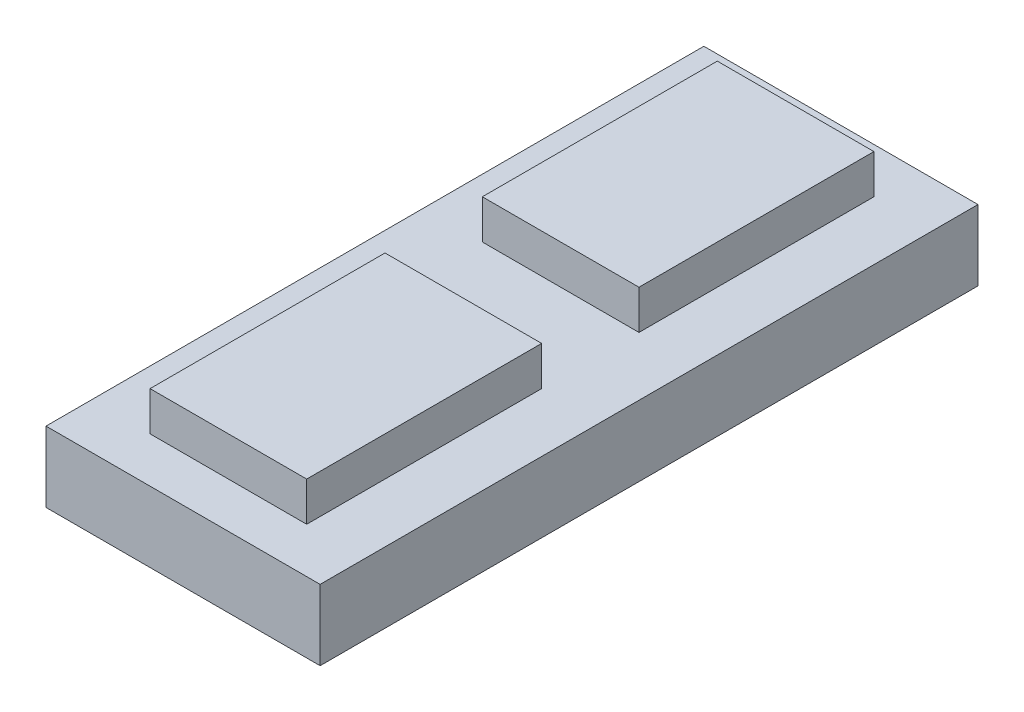
ISO-10303-21;
HEADER;
FILE_DESCRIPTION(('STEP AP214'),'2;1');
FILE_NAME('part.step','',(''),(''),'','','');
FILE_SCHEMA(('AUTOMOTIVE_DESIGN { 1 0 10303 214 1 1 1 1 }'));
ENDSEC;
DATA;
#1=APPLICATION_CONTEXT('core data for automotive mechanical design processes');
#2=APPLICATION_PROTOCOL_DEFINITION('international standard','automotive_design',2000,#1);
#3=PRODUCT_CONTEXT('',#1,'mechanical');
#4=PRODUCT('Part','Part','',(#3));
#5=PRODUCT_RELATED_PRODUCT_CATEGORY('part','',(#4));
#6=PRODUCT_DEFINITION_FORMATION('','',#4);
#7=PRODUCT_DEFINITION_CONTEXT('part definition',#1,'design');
#8=PRODUCT_DEFINITION('design','',#6,#7);
#9=PRODUCT_DEFINITION_SHAPE('','',#8);
#10=(LENGTH_UNIT() NAMED_UNIT(*) SI_UNIT(.MILLI.,.METRE.));
#11=(NAMED_UNIT(*) PLANE_ANGLE_UNIT() SI_UNIT($,.RADIAN.));
#12=(NAMED_UNIT(*) SI_UNIT($,.STERADIAN.) SOLID_ANGLE_UNIT());
#13=UNCERTAINTY_MEASURE_WITH_UNIT(LENGTH_MEASURE(1.E-05),#10,'distance_accuracy_value','');
#14=(GEOMETRIC_REPRESENTATION_CONTEXT(3) GLOBAL_UNCERTAINTY_ASSIGNED_CONTEXT((#13)) GLOBAL_UNIT_ASSIGNED_CONTEXT((#10,
#11,#12)) REPRESENTATION_CONTEXT('',''));
#15=CARTESIAN_POINT('',(0.,0.,0.));
#16=DIRECTION('',(0.,0.,1.));
#17=DIRECTION('',(1.,0.,0.));
#18=AXIS2_PLACEMENT_3D('',#15,#16,#17);
#19=CARTESIAN_POINT('',(0.,14.,6.213224670746));
#20=DIRECTION('',(0.,0.,-1.));
#21=DIRECTION('',(-1.,0.,0.));
#22=AXIS2_PLACEMENT_3D('',#19,#20,#21);
#23=PLANE('',#22);
#24=DIRECTION('',(1.,0.,0.));
#25=VECTOR('',#24,1.);
#26=CARTESIAN_POINT('',(0.,9.,6.213224670746));
#27=LINE('',#26,#25);
#28=CARTESIAN_POINT('',(-10.,9.,6.213224670746));
#29=VERTEX_POINT('',#28);
#30=CARTESIAN_POINT('',(10.,9.,6.213224670746));
#31=VERTEX_POINT('',#30);
#32=EDGE_CURVE('E127',#29,#31,#27,.T.);
#33=ORIENTED_EDGE('',*,*,#32,.F.);
#34=DIRECTION('',(0.,-1.,0.));
#35=VECTOR('',#34,1.);
#36=CARTESIAN_POINT('',(-10.,14.,6.213224670746));
#37=LINE('',#36,#35);
#38=CARTESIAN_POINT('',(-10.,14.,6.213224670746));
#39=VERTEX_POINT('',#38);
#40=EDGE_CURVE('E12',#39,#29,#37,.T.);
#41=ORIENTED_EDGE('',*,*,#40,.F.);
#42=DIRECTION('',(1.,0.,0.));
#43=VECTOR('',#42,1.);
#44=CARTESIAN_POINT('',(0.,14.,6.213224670746));
#45=LINE('',#44,#43);
#46=CARTESIAN_POINT('',(10.,14.,6.213224670746));
#47=VERTEX_POINT('',#46);
#48=EDGE_CURVE('E112',#39,#47,#45,.T.);
#49=ORIENTED_EDGE('',*,*,#48,.T.);
#50=DIRECTION('',(0.,-1.,0.));
#51=VECTOR('',#50,1.);
#52=CARTESIAN_POINT('',(10.,14.,6.213224670746));
#53=LINE('',#52,#51);
#54=EDGE_CURVE('E80',#47,#31,#53,.T.);
#55=ORIENTED_EDGE('',*,*,#54,.T.);
#56=EDGE_LOOP('',(#33,#41,#49,#55));
#57=FACE_BOUND('',#56,.T.);
#58=ADVANCED_FACE('F64',(#57),#23,.T.);
#59=CARTESIAN_POINT('',(-10.,14.,0.));
#60=DIRECTION('',(1.,0.,0.));
#61=DIRECTION('',(0.,0.,-1.));
#62=AXIS2_PLACEMENT_3D('',#59,#60,#61);
#63=PLANE('',#62);
#64=DIRECTION('',(0.,0.,1.));
#65=VECTOR('',#64,1.);
#66=CARTESIAN_POINT('',(-10.,9.,0.));
#67=LINE('',#66,#65);
#68=CARTESIAN_POINT('',(-10.,9.,36.213224670746));
#69=VERTEX_POINT('',#68);
#70=EDGE_CURVE('E118',#29,#69,#67,.T.);
#71=ORIENTED_EDGE('',*,*,#70,.T.);
#72=DIRECTION('',(0.,-1.,0.));
#73=VECTOR('',#72,1.);
#74=CARTESIAN_POINT('',(-10.,14.,36.213224670746));
#75=LINE('',#74,#73);
#76=CARTESIAN_POINT('',(-10.,14.,36.213224670746));
#77=VERTEX_POINT('',#76);
#78=EDGE_CURVE('E72',#77,#69,#75,.T.);
#79=ORIENTED_EDGE('',*,*,#78,.F.);
#80=DIRECTION('',(0.,0.,1.));
#81=VECTOR('',#80,1.);
#82=CARTESIAN_POINT('',(-10.,14.,0.));
#83=LINE('',#82,#81);
#84=EDGE_CURVE('E106',#39,#77,#83,.T.);
#85=ORIENTED_EDGE('',*,*,#84,.F.);
#86=ORIENTED_EDGE('',*,*,#40,.T.);
#87=EDGE_LOOP('',(#71,#79,#85,#86));
#88=FACE_BOUND('',#87,.T.);
#89=ADVANCED_FACE('F116',(#88),#63,.F.);
#90=CARTESIAN_POINT('',(0.,14.,36.213224670746));
#91=DIRECTION('',(0.,0.,-1.));
#92=DIRECTION('',(-1.,0.,0.));
#93=AXIS2_PLACEMENT_3D('',#90,#91,#92);
#94=PLANE('',#93);
#95=DIRECTION('',(1.,0.,0.));
#96=VECTOR('',#95,1.);
#97=CARTESIAN_POINT('',(0.,9.,36.213224670746));
#98=LINE('',#97,#96);
#99=CARTESIAN_POINT('',(10.,9.,36.213224670746));
#100=VERTEX_POINT('',#99);
#101=EDGE_CURVE('E130',#69,#100,#98,.T.);
#102=ORIENTED_EDGE('',*,*,#101,.T.);
#103=DIRECTION('',(0.,-1.,0.));
#104=VECTOR('',#103,1.);
#105=CARTESIAN_POINT('',(10.,14.,36.213224670746));
#106=LINE('',#105,#104);
#107=CARTESIAN_POINT('',(10.,14.,36.213224670746));
#108=VERTEX_POINT('',#107);
#109=EDGE_CURVE('E94',#108,#100,#106,.T.);
#110=ORIENTED_EDGE('',*,*,#109,.F.);
#111=DIRECTION('',(1.,0.,0.));
#112=VECTOR('',#111,1.);
#113=CARTESIAN_POINT('',(0.,14.,36.213224670746));
#114=LINE('',#113,#112);
#115=EDGE_CURVE('E111',#77,#108,#114,.T.);
#116=ORIENTED_EDGE('',*,*,#115,.F.);
#117=ORIENTED_EDGE('',*,*,#78,.T.);
#118=EDGE_LOOP('',(#102,#110,#116,#117));
#119=FACE_BOUND('',#118,.T.);
#120=ADVANCED_FACE('F121',(#119),#94,.F.);
#121=CARTESIAN_POINT('',(10.,14.,0.));
#122=DIRECTION('',(1.,0.,0.));
#123=DIRECTION('',(0.,0.,-1.));
#124=AXIS2_PLACEMENT_3D('',#121,#122,#123);
#125=PLANE('',#124);
#126=DIRECTION('',(0.,0.,1.));
#127=VECTOR('',#126,1.);
#128=CARTESIAN_POINT('',(10.,9.,0.));
#129=LINE('',#128,#127);
#130=EDGE_CURVE('E132',#31,#100,#129,.T.);
#131=ORIENTED_EDGE('',*,*,#130,.F.);
#132=ORIENTED_EDGE('',*,*,#54,.F.);
#133=DIRECTION('',(0.,0.,1.));
#134=VECTOR('',#133,1.);
#135=CARTESIAN_POINT('',(10.,14.,0.));
#136=LINE('',#135,#134);
#137=EDGE_CURVE('E122',#47,#108,#136,.T.);
#138=ORIENTED_EDGE('',*,*,#137,.T.);
#139=ORIENTED_EDGE('',*,*,#109,.T.);
#140=EDGE_LOOP('',(#131,#132,#138,#139));
#141=FACE_BOUND('',#140,.T.);
#142=ADVANCED_FACE('F137',(#141),#125,.T.);
#143=CARTESIAN_POINT('',(0.,14.,0.));
#144=DIRECTION('',(0.,1.,0.));
#145=DIRECTION('',(0.,0.,1.));
#146=AXIS2_PLACEMENT_3D('',#143,#144,#145);
#147=PLANE('',#146);
#148=ORIENTED_EDGE('',*,*,#48,.F.);
#149=ORIENTED_EDGE('',*,*,#84,.T.);
#150=ORIENTED_EDGE('',*,*,#115,.T.);
#151=ORIENTED_EDGE('',*,*,#137,.F.);
#152=EDGE_LOOP('',(#148,#149,#150,#151));
#153=FACE_BOUND('',#152,.T.);
#154=ADVANCED_FACE('F108',(#153),#147,.T.);
#155=CARTESIAN_POINT('',(0.,9.,0.));
#156=DIRECTION('',(0.,1.,0.));
#157=DIRECTION('',(0.,0.,1.));
#158=AXIS2_PLACEMENT_3D('',#155,#156,#157);
#159=PLANE('',#158);
#160=ORIENTED_EDGE('',*,*,#32,.T.);
#161=ORIENTED_EDGE('',*,*,#130,.T.);
#162=ORIENTED_EDGE('',*,*,#101,.F.);
#163=ORIENTED_EDGE('',*,*,#70,.F.);
#164=EDGE_LOOP('',(#160,#161,#162,#163));
#165=FACE_BOUND('',#164,.T.);
#166=ADVANCED_FACE('F144',(#165),#159,.F.);
#167=CLOSED_SHELL('',(#58,#89,#120,#142,#154,#166));
#168=MANIFOLD_SOLID_BREP('B2',#167);
#169=CARTESIAN_POINT('',(-10.,14.,0.));
#170=DIRECTION('',(1.,0.,0.));
#171=DIRECTION('',(0.,0.,-1.));
#172=AXIS2_PLACEMENT_3D('',#169,#170,#171);
#173=PLANE('',#172);
#174=DIRECTION('',(0.,0.,1.));
#175=VECTOR('',#174,1.);
#176=CARTESIAN_POINT('',(-10.,9.,0.));
#177=LINE('',#176,#175);
#178=CARTESIAN_POINT('',(-10.,9.,-36.213224670746));
#179=VERTEX_POINT('',#178);
#180=CARTESIAN_POINT('',(-10.,9.,-6.21322467074599));
#181=VERTEX_POINT('',#180);
#182=EDGE_CURVE('E290',#179,#181,#177,.T.);
#183=ORIENTED_EDGE('',*,*,#182,.T.);
#184=DIRECTION('',(0.,-1.,0.));
#185=VECTOR('',#184,1.);
#186=CARTESIAN_POINT('',(-10.,14.,-6.21322467074599));
#187=LINE('',#186,#185);
#188=CARTESIAN_POINT('',(-10.,14.,-6.21322467074599));
#189=VERTEX_POINT('',#188);
#190=EDGE_CURVE('E62',#189,#181,#187,.T.);
#191=ORIENTED_EDGE('',*,*,#190,.F.);
#192=DIRECTION('',(0.,0.,1.));
#193=VECTOR('',#192,1.);
#194=CARTESIAN_POINT('',(-10.,14.,0.));
#195=LINE('',#194,#193);
#196=CARTESIAN_POINT('',(-10.,14.,-36.213224670746));
#197=VERTEX_POINT('',#196);
#198=EDGE_CURVE('E276',#197,#189,#195,.T.);
#199=ORIENTED_EDGE('',*,*,#198,.F.);
#200=DIRECTION('',(0.,-1.,0.));
#201=VECTOR('',#200,1.);
#202=CARTESIAN_POINT('',(-10.,14.,-36.213224670746));
#203=LINE('',#202,#201);
#204=EDGE_CURVE('E243',#197,#179,#203,.T.);
#205=ORIENTED_EDGE('',*,*,#204,.T.);
#206=EDGE_LOOP('',(#183,#191,#199,#205));
#207=FACE_BOUND('',#206,.T.);
#208=ADVANCED_FACE('F227',(#207),#173,.F.);
#209=CARTESIAN_POINT('',(0.,14.,-6.21322467074599));
#210=DIRECTION('',(0.,0.,-1.));
#211=DIRECTION('',(-1.,0.,0.));
#212=AXIS2_PLACEMENT_3D('',#209,#210,#211);
#213=PLANE('',#212);
#214=DIRECTION('',(1.,0.,0.));
#215=VECTOR('',#214,1.);
#216=CARTESIAN_POINT('',(0.,9.,-6.21322467074599));
#217=LINE('',#216,#215);
#218=CARTESIAN_POINT('',(10.,9.,-6.21322467074599));
#219=VERTEX_POINT('',#218);
#220=EDGE_CURVE('E281',#181,#219,#217,.T.);
#221=ORIENTED_EDGE('',*,*,#220,.T.);
#222=DIRECTION('',(0.,-1.,0.));
#223=VECTOR('',#222,1.);
#224=CARTESIAN_POINT('',(10.,14.,-6.21322467074599));
#225=LINE('',#224,#223);
#226=CARTESIAN_POINT('',(10.,14.,-6.21322467074599));
#227=VERTEX_POINT('',#226);
#228=EDGE_CURVE('E235',#227,#219,#225,.T.);
#229=ORIENTED_EDGE('',*,*,#228,.F.);
#230=DIRECTION('',(1.,0.,0.));
#231=VECTOR('',#230,1.);
#232=CARTESIAN_POINT('',(0.,14.,-6.21322467074599));
#233=LINE('',#232,#231);
#234=EDGE_CURVE('E268',#189,#227,#233,.T.);
#235=ORIENTED_EDGE('',*,*,#234,.F.);
#236=ORIENTED_EDGE('',*,*,#190,.T.);
#237=EDGE_LOOP('',(#221,#229,#235,#236));
#238=FACE_BOUND('',#237,.T.);
#239=ADVANCED_FACE('F280',(#238),#213,.F.);
#240=CARTESIAN_POINT('',(10.,14.,0.));
#241=DIRECTION('',(1.,0.,0.));
#242=DIRECTION('',(0.,0.,-1.));
#243=AXIS2_PLACEMENT_3D('',#240,#241,#242);
#244=PLANE('',#243);
#245=DIRECTION('',(0.,0.,1.));
#246=VECTOR('',#245,1.);
#247=CARTESIAN_POINT('',(10.,9.,0.));
#248=LINE('',#247,#246);
#249=CARTESIAN_POINT('',(10.,9.,-36.213224670746));
#250=VERTEX_POINT('',#249);
#251=EDGE_CURVE('E293',#250,#219,#248,.T.);
#252=ORIENTED_EDGE('',*,*,#251,.F.);
#253=DIRECTION('',(0.,-1.,0.));
#254=VECTOR('',#253,1.);
#255=CARTESIAN_POINT('',(10.,14.,-36.213224670746));
#256=LINE('',#255,#254);
#257=CARTESIAN_POINT('',(10.,14.,-36.213224670746));
#258=VERTEX_POINT('',#257);
#259=EDGE_CURVE('E257',#258,#250,#256,.T.);
#260=ORIENTED_EDGE('',*,*,#259,.F.);
#261=DIRECTION('',(0.,0.,1.));
#262=VECTOR('',#261,1.);
#263=CARTESIAN_POINT('',(10.,14.,0.));
#264=LINE('',#263,#262);
#265=EDGE_CURVE('E275',#258,#227,#264,.T.);
#266=ORIENTED_EDGE('',*,*,#265,.T.);
#267=ORIENTED_EDGE('',*,*,#228,.T.);
#268=EDGE_LOOP('',(#252,#260,#266,#267));
#269=FACE_BOUND('',#268,.T.);
#270=ADVANCED_FACE('F284',(#269),#244,.T.);
#271=CARTESIAN_POINT('',(0.,14.,-36.213224670746));
#272=DIRECTION('',(0.,0.,-1.));
#273=DIRECTION('',(-1.,0.,0.));
#274=AXIS2_PLACEMENT_3D('',#271,#272,#273);
#275=PLANE('',#274);
#276=DIRECTION('',(1.,0.,0.));
#277=VECTOR('',#276,1.);
#278=CARTESIAN_POINT('',(0.,9.,-36.213224670746));
#279=LINE('',#278,#277);
#280=EDGE_CURVE('E295',#179,#250,#279,.T.);
#281=ORIENTED_EDGE('',*,*,#280,.F.);
#282=ORIENTED_EDGE('',*,*,#204,.F.);
#283=DIRECTION('',(1.,0.,0.));
#284=VECTOR('',#283,1.);
#285=CARTESIAN_POINT('',(0.,14.,-36.213224670746));
#286=LINE('',#285,#284);
#287=EDGE_CURVE('E285',#197,#258,#286,.T.);
#288=ORIENTED_EDGE('',*,*,#287,.T.);
#289=ORIENTED_EDGE('',*,*,#259,.T.);
#290=EDGE_LOOP('',(#281,#282,#288,#289));
#291=FACE_BOUND('',#290,.T.);
#292=ADVANCED_FACE('F301',(#291),#275,.T.);
#293=CARTESIAN_POINT('',(0.,14.,0.));
#294=DIRECTION('',(0.,1.,0.));
#295=DIRECTION('',(0.,0.,1.));
#296=AXIS2_PLACEMENT_3D('',#293,#294,#295);
#297=PLANE('',#296);
#298=ORIENTED_EDGE('',*,*,#198,.T.);
#299=ORIENTED_EDGE('',*,*,#234,.T.);
#300=ORIENTED_EDGE('',*,*,#265,.F.);
#301=ORIENTED_EDGE('',*,*,#287,.F.);
#302=EDGE_LOOP('',(#298,#299,#300,#301));
#303=FACE_BOUND('',#302,.T.);
#304=ADVANCED_FACE('F272',(#303),#297,.T.);
#305=CARTESIAN_POINT('',(0.,9.,0.));
#306=DIRECTION('',(0.,1.,0.));
#307=DIRECTION('',(0.,0.,1.));
#308=AXIS2_PLACEMENT_3D('',#305,#306,#307);
#309=PLANE('',#308);
#310=ORIENTED_EDGE('',*,*,#182,.F.);
#311=ORIENTED_EDGE('',*,*,#280,.T.);
#312=ORIENTED_EDGE('',*,*,#251,.T.);
#313=ORIENTED_EDGE('',*,*,#220,.F.);
#314=EDGE_LOOP('',(#310,#311,#312,#313));
#315=FACE_BOUND('',#314,.T.);
#316=ADVANCED_FACE('F300',(#315),#309,.F.);
#317=CLOSED_SHELL('',(#208,#239,#270,#292,#304,#316));
#318=MANIFOLD_SOLID_BREP('B6',#317);
#319=CARTESIAN_POINT('',(17.5,9.,-42.));
#320=DIRECTION('',(-1.,0.,0.));
#321=DIRECTION('',(0.,0.,1.));
#322=AXIS2_PLACEMENT_3D('',#319,#320,#321);
#323=PLANE('',#322);
#324=DIRECTION('',(0.,0.,-1.));
#325=VECTOR('',#324,1.);
#326=CARTESIAN_POINT('',(17.5,0.,-42.));
#327=LINE('',#326,#325);
#328=CARTESIAN_POINT('',(17.5,0.,42.));
#329=VERTEX_POINT('',#328);
#330=CARTESIAN_POINT('',(17.5,0.,-42.));
#331=VERTEX_POINT('',#330);
#332=EDGE_CURVE('E449',#329,#331,#327,.T.);
#333=ORIENTED_EDGE('',*,*,#332,.T.);
#334=DIRECTION('',(0.,-1.,0.));
#335=VECTOR('',#334,1.);
#336=CARTESIAN_POINT('',(17.5,9.,-42.));
#337=LINE('',#336,#335);
#338=CARTESIAN_POINT('',(17.5,9.,-42.));
#339=VERTEX_POINT('',#338);
#340=EDGE_CURVE('E225',#339,#331,#337,.T.);
#341=ORIENTED_EDGE('',*,*,#340,.F.);
#342=DIRECTION('',(0.,0.,-1.));
#343=VECTOR('',#342,1.);
#344=CARTESIAN_POINT('',(17.5,9.,-42.));
#345=LINE('',#344,#343);
#346=CARTESIAN_POINT('',(17.5,9.,42.));
#347=VERTEX_POINT('',#346);
#348=EDGE_CURVE('E433',#347,#339,#345,.T.);
#349=ORIENTED_EDGE('',*,*,#348,.F.);
#350=DIRECTION('',(0.,-1.,0.));
#351=VECTOR('',#350,1.);
#352=CARTESIAN_POINT('',(17.5,9.,42.));
#353=LINE('',#352,#351);
#354=EDGE_CURVE('E445',#347,#329,#353,.T.);
#355=ORIENTED_EDGE('',*,*,#354,.T.);
#356=EDGE_LOOP('',(#333,#341,#349,#355));
#357=FACE_BOUND('',#356,.T.);
#358=ADVANCED_FACE('F381',(#357),#323,.F.);
#359=CARTESIAN_POINT('',(-17.5,9.,-42.));
#360=DIRECTION('',(0.,0.,1.));
#361=DIRECTION('',(1.,0.,0.));
#362=AXIS2_PLACEMENT_3D('',#359,#360,#361);
#363=PLANE('',#362);
#364=DIRECTION('',(-1.,0.,0.));
#365=VECTOR('',#364,1.);
#366=CARTESIAN_POINT('',(-17.5,0.,-42.));
#367=LINE('',#366,#365);
#368=CARTESIAN_POINT('',(-17.5,0.,-42.));
#369=VERTEX_POINT('',#368);
#370=EDGE_CURVE('E438',#331,#369,#367,.T.);
#371=ORIENTED_EDGE('',*,*,#370,.T.);
#372=DIRECTION('',(0.,-1.,0.));
#373=VECTOR('',#372,1.);
#374=CARTESIAN_POINT('',(-17.5,9.,-42.));
#375=LINE('',#374,#373);
#376=CARTESIAN_POINT('',(-17.5,9.,-42.));
#377=VERTEX_POINT('',#376);
#378=EDGE_CURVE('E390',#377,#369,#375,.T.);
#379=ORIENTED_EDGE('',*,*,#378,.F.);
#380=DIRECTION('',(-1.,0.,0.));
#381=VECTOR('',#380,1.);
#382=CARTESIAN_POINT('',(-17.5,9.,-42.));
#383=LINE('',#382,#381);
#384=EDGE_CURVE('E428',#339,#377,#383,.T.);
#385=ORIENTED_EDGE('',*,*,#384,.F.);
#386=ORIENTED_EDGE('',*,*,#340,.T.);
#387=EDGE_LOOP('',(#371,#379,#385,#386));
#388=FACE_BOUND('',#387,.T.);
#389=ADVANCED_FACE('F437',(#388),#363,.F.);
#390=CARTESIAN_POINT('',(-17.5,9.,-42.));
#391=DIRECTION('',(1.,0.,0.));
#392=DIRECTION('',(0.,0.,-1.));
#393=AXIS2_PLACEMENT_3D('',#390,#391,#392);
#394=PLANE('',#393);
#395=DIRECTION('',(0.,0.,1.));
#396=VECTOR('',#395,1.);
#397=CARTESIAN_POINT('',(-17.5,0.,-42.));
#398=LINE('',#397,#396);
#399=CARTESIAN_POINT('',(-17.5,0.,42.));
#400=VERTEX_POINT('',#399);
#401=EDGE_CURVE('E415',#369,#400,#398,.T.);
#402=ORIENTED_EDGE('',*,*,#401,.T.);
#403=DIRECTION('',(0.,-1.,0.));
#404=VECTOR('',#403,1.);
#405=CARTESIAN_POINT('',(-17.5,9.,42.));
#406=LINE('',#405,#404);
#407=CARTESIAN_POINT('',(-17.5,9.,42.));
#408=VERTEX_POINT('',#407);
#409=EDGE_CURVE('E440',#408,#400,#406,.T.);
#410=ORIENTED_EDGE('',*,*,#409,.F.);
#411=DIRECTION('',(0.,0.,1.));
#412=VECTOR('',#411,1.);
#413=CARTESIAN_POINT('',(-17.5,9.,-42.));
#414=LINE('',#413,#412);
#415=EDGE_CURVE('E431',#377,#408,#414,.T.);
#416=ORIENTED_EDGE('',*,*,#415,.F.);
#417=ORIENTED_EDGE('',*,*,#378,.T.);
#418=EDGE_LOOP('',(#402,#410,#416,#417));
#419=FACE_BOUND('',#418,.T.);
#420=ADVANCED_FACE('F441',(#419),#394,.F.);
#421=CARTESIAN_POINT('',(-17.5,9.,42.));
#422=DIRECTION('',(0.,0.,-1.));
#423=DIRECTION('',(-1.,0.,0.));
#424=AXIS2_PLACEMENT_3D('',#421,#422,#423);
#425=PLANE('',#424);
#426=DIRECTION('',(1.,0.,0.));
#427=VECTOR('',#426,1.);
#428=CARTESIAN_POINT('',(-17.5,0.,42.));
#429=LINE('',#428,#427);
#430=EDGE_CURVE('E421',#400,#329,#429,.T.);
#431=ORIENTED_EDGE('',*,*,#430,.T.);
#432=ORIENTED_EDGE('',*,*,#354,.F.);
#433=DIRECTION('',(1.,0.,0.));
#434=VECTOR('',#433,1.);
#435=CARTESIAN_POINT('',(-17.5,9.,42.));
#436=LINE('',#435,#434);
#437=EDGE_CURVE('E398',#408,#347,#436,.T.);
#438=ORIENTED_EDGE('',*,*,#437,.F.);
#439=ORIENTED_EDGE('',*,*,#409,.T.);
#440=EDGE_LOOP('',(#431,#432,#438,#439));
#441=FACE_BOUND('',#440,.T.);
#442=ADVANCED_FACE('F462',(#441),#425,.F.);
#443=CARTESIAN_POINT('',(0.,9.,0.));
#444=DIRECTION('',(0.,1.,0.));
#445=DIRECTION('',(0.,0.,1.));
#446=AXIS2_PLACEMENT_3D('',#443,#444,#445);
#447=PLANE('',#446);
#448=ORIENTED_EDGE('',*,*,#348,.T.);
#449=ORIENTED_EDGE('',*,*,#384,.T.);
#450=ORIENTED_EDGE('',*,*,#415,.T.);
#451=ORIENTED_EDGE('',*,*,#437,.T.);
#452=EDGE_LOOP('',(#448,#449,#450,#451));
#453=FACE_BOUND('',#452,.T.);
#454=ADVANCED_FACE('F429',(#453),#447,.T.);
#455=CARTESIAN_POINT('',(0.,0.,0.));
#456=DIRECTION('',(0.,1.,0.));
#457=DIRECTION('',(0.,0.,1.));
#458=AXIS2_PLACEMENT_3D('',#455,#456,#457);
#459=PLANE('',#458);
#460=ORIENTED_EDGE('',*,*,#332,.F.);
#461=ORIENTED_EDGE('',*,*,#430,.F.);
#462=ORIENTED_EDGE('',*,*,#401,.F.);
#463=ORIENTED_EDGE('',*,*,#370,.F.);
#464=EDGE_LOOP('',(#460,#461,#462,#463));
#465=FACE_BOUND('',#464,.T.);
#466=ADVANCED_FACE('F465',(#465),#459,.F.);
#467=CLOSED_SHELL('',(#358,#389,#420,#442,#454,#466));
#468=MANIFOLD_SOLID_BREP('B56',#467);
#469=ADVANCED_BREP_SHAPE_REPRESENTATION('',(#18,#168,#318,#468),#14);
#470=SHAPE_DEFINITION_REPRESENTATION(#9,#469);
ENDSEC;
END-ISO-10303-21;
